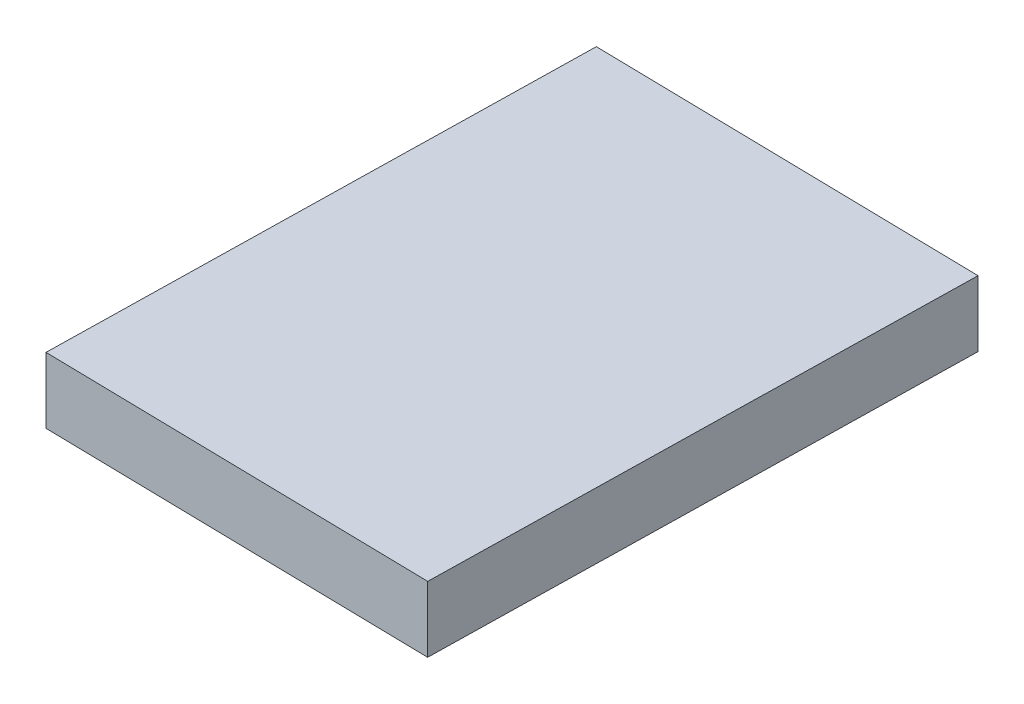
ISO-10303-21;
HEADER;
FILE_DESCRIPTION(('STEP AP214'),'2;1');
FILE_NAME('part.step','',(''),(''),'','','');
FILE_SCHEMA(('AUTOMOTIVE_DESIGN { 1 0 10303 214 1 1 1 1 }'));
ENDSEC;
DATA;
#1=APPLICATION_CONTEXT('core data for automotive mechanical design processes');
#2=APPLICATION_PROTOCOL_DEFINITION('international standard','automotive_design',2000,#1);
#3=PRODUCT_CONTEXT('',#1,'mechanical');
#4=PRODUCT('Part','Part','',(#3));
#5=PRODUCT_RELATED_PRODUCT_CATEGORY('part','',(#4));
#6=PRODUCT_DEFINITION_FORMATION('','',#4);
#7=PRODUCT_DEFINITION_CONTEXT('part definition',#1,'design');
#8=PRODUCT_DEFINITION('design','',#6,#7);
#9=PRODUCT_DEFINITION_SHAPE('','',#8);
#10=(LENGTH_UNIT() NAMED_UNIT(*) SI_UNIT(.MILLI.,.METRE.));
#11=(NAMED_UNIT(*) PLANE_ANGLE_UNIT() SI_UNIT($,.RADIAN.));
#12=(NAMED_UNIT(*) SI_UNIT($,.STERADIAN.) SOLID_ANGLE_UNIT());
#13=UNCERTAINTY_MEASURE_WITH_UNIT(LENGTH_MEASURE(1.E-05),#10,'distance_accuracy_value','');
#14=(GEOMETRIC_REPRESENTATION_CONTEXT(3) GLOBAL_UNCERTAINTY_ASSIGNED_CONTEXT((#13)) GLOBAL_UNIT_ASSIGNED_CONTEXT((#10,
#11,#12)) REPRESENTATION_CONTEXT('',''));
#15=CARTESIAN_POINT('',(0.,0.,0.));
#16=DIRECTION('',(0.,0.,1.));
#17=DIRECTION('',(1.,0.,0.));
#18=AXIS2_PLACEMENT_3D('',#15,#16,#17);
#19=CARTESIAN_POINT('',(-0.387656007981527,-0.780392670707814,32.6889272074211));
#20=DIRECTION('',(0.,1.,0.));
#21=DIRECTION('',(1.,0.,0.));
#22=AXIS2_PLACEMENT_3D('',#19,#20,#21);
#23=PLANE('',#22);
#24=DIRECTION('',(0.999812677663925,0.,0.0193548335692299));
#25=VECTOR('',#24,1.);
#26=CARTESIAN_POINT('',(-9.16084763194295,-0.780392670708278,20.0072479818905));
#27=LINE('',#26,#25);
#28=CARTESIAN_POINT('',(-9.16084763194288,-0.780392670708188,20.0072479818905));
#29=VERTEX_POINT('',#28);
#30=CARTESIAN_POINT('',(8.86977419704837,-0.780392670707841,20.356293050478));
#31=VERTEX_POINT('',#30);
#32=EDGE_CURVE('E56',#29,#31,#27,.T.);
#33=ORIENTED_EDGE('',*,*,#32,.T.);
#34=DIRECTION('',(-0.0193548335692301,0.,0.999812677663925));
#35=VECTOR('',#34,1.);
#36=CARTESIAN_POINT('',(8.3855356159798,-0.780392670707703,45.3706064329517));
#37=LINE('',#36,#35);
#38=CARTESIAN_POINT('',(8.38553561597977,-0.780392670707446,45.3706064329517));
#39=VERTEX_POINT('',#38);
#40=EDGE_CURVE('E58',#31,#39,#37,.T.);
#41=ORIENTED_EDGE('',*,*,#40,.T.);
#42=DIRECTION('',(-0.999812677663925,0.,-0.0193548335692299));
#43=VECTOR('',#42,1.);
#44=CARTESIAN_POINT('',(-9.64508621301152,-0.780392670707363,45.0215613643643));
#45=LINE('',#44,#43);
#46=CARTESIAN_POINT('',(-9.64508621301142,-0.780392670707647,45.0215613643642));
#47=VERTEX_POINT('',#46);
#48=EDGE_CURVE('E20',#39,#47,#45,.T.);
#49=ORIENTED_EDGE('',*,*,#48,.T.);
#50=DIRECTION('',(0.0193548335692301,0.,-0.999812677663925));
#51=VECTOR('',#50,1.);
#52=CARTESIAN_POINT('',(-9.64508621301142,-0.780392670707938,45.0215613643642));
#53=LINE('',#52,#51);
#54=EDGE_CURVE('E88',#47,#29,#53,.T.);
#55=ORIENTED_EDGE('',*,*,#54,.T.);
#56=EDGE_LOOP('',(#33,#41,#49,#55));
#57=FACE_BOUND('',#56,.T.);
#58=ADVANCED_FACE('F17',(#57),#23,.F.);
#59=CARTESIAN_POINT('',(-9.64508621301152,2.26760732929205,45.0215613643642));
#60=DIRECTION('',(0.0193548335692299,0.,-0.999812677663925));
#61=DIRECTION('',(-0.999812677663925,0.,-0.0193548335692299));
#62=AXIS2_PLACEMENT_3D('',#59,#60,#61);
#63=PLANE('',#62);
#64=ORIENTED_EDGE('',*,*,#48,.F.);
#65=DIRECTION('',(0.,1.,0.));
#66=VECTOR('',#65,1.);
#67=CARTESIAN_POINT('',(8.3855356159797,2.26760732929264,45.3706064329517));
#68=LINE('',#67,#66);
#69=CARTESIAN_POINT('',(8.3855356159797,2.26760732929235,45.3706064329517));
#70=VERTEX_POINT('',#69);
#71=EDGE_CURVE('E65',#39,#70,#68,.T.);
#72=ORIENTED_EDGE('',*,*,#71,.T.);
#73=DIRECTION('',(0.999812677663925,0.,0.0193548335692301));
#74=VECTOR('',#73,1.);
#75=CARTESIAN_POINT('',(-9.64508621301152,2.26760732929207,45.0215613643642));
#76=LINE('',#75,#74);
#77=CARTESIAN_POINT('',(-9.64508621301147,2.26760732929198,45.0215613643642));
#78=VERTEX_POINT('',#77);
#79=EDGE_CURVE('E93',#78,#70,#76,.T.);
#80=ORIENTED_EDGE('',*,*,#79,.F.);
#81=DIRECTION('',(0.,1.,0.));
#82=VECTOR('',#81,1.);
#83=CARTESIAN_POINT('',(-9.64508621301152,2.26760732929205,45.0215613643642));
#84=LINE('',#83,#82);
#85=EDGE_CURVE('E70',#78,#47,#84,.F.);
#86=ORIENTED_EDGE('',*,*,#85,.T.);
#87=EDGE_LOOP('',(#64,#72,#80,#86));
#88=FACE_BOUND('',#87,.T.);
#89=ADVANCED_FACE('F67',(#88),#63,.F.);
#90=CARTESIAN_POINT('',(8.3855356159797,2.26760732929264,45.3706064329517));
#91=DIRECTION('',(-0.999812677663925,0.,-0.0193548335692301));
#92=DIRECTION('',(-0.0193548335692301,0.,0.999812677663925));
#93=AXIS2_PLACEMENT_3D('',#90,#91,#92);
#94=PLANE('',#93);
#95=ORIENTED_EDGE('',*,*,#40,.F.);
#96=DIRECTION('',(0.,1.,0.));
#97=VECTOR('',#96,1.);
#98=CARTESIAN_POINT('',(8.86977419704837,2.26760732929172,20.356293050478));
#99=LINE('',#98,#97);
#100=CARTESIAN_POINT('',(8.86977419704829,2.26760732929248,20.356293050478));
#101=VERTEX_POINT('',#100);
#102=EDGE_CURVE('E81',#31,#101,#99,.T.);
#103=ORIENTED_EDGE('',*,*,#102,.T.);
#104=DIRECTION('',(0.0193548335692301,0.,-0.999812677663925));
#105=VECTOR('',#104,1.);
#106=CARTESIAN_POINT('',(8.3855356159797,2.26760732929264,45.3706064329517));
#107=LINE('',#106,#105);
#108=EDGE_CURVE('E75',#70,#101,#107,.T.);
#109=ORIENTED_EDGE('',*,*,#108,.F.);
#110=ORIENTED_EDGE('',*,*,#71,.F.);
#111=EDGE_LOOP('',(#95,#103,#109,#110));
#112=FACE_BOUND('',#111,.T.);
#113=ADVANCED_FACE('F73',(#112),#94,.F.);
#114=CARTESIAN_POINT('',(-9.16084763194295,2.26760732929172,20.0072479818905));
#115=DIRECTION('',(-0.0193548335692299,0.,0.999812677663925));
#116=DIRECTION('',(0.999812677663925,0.,0.0193548335692299));
#117=AXIS2_PLACEMENT_3D('',#114,#115,#116);
#118=PLANE('',#117);
#119=ORIENTED_EDGE('',*,*,#32,.F.);
#120=DIRECTION('',(0.,1.,0.));
#121=VECTOR('',#120,1.);
#122=CARTESIAN_POINT('',(-9.16084763194295,2.26760732929205,20.0072479818905));
#123=LINE('',#122,#121);
#124=CARTESIAN_POINT('',(-9.16084763194295,2.26760732929201,20.0072479818905));
#125=VERTEX_POINT('',#124);
#126=EDGE_CURVE('E36',#29,#125,#123,.T.);
#127=ORIENTED_EDGE('',*,*,#126,.T.);
#128=DIRECTION('',(-0.999812677663925,0.,-0.0193548335692299));
#129=VECTOR('',#128,1.);
#130=CARTESIAN_POINT('',(8.86977419704827,2.2676073292923,20.356293050478));
#131=LINE('',#130,#129);
#132=EDGE_CURVE('E27',#101,#125,#131,.T.);
#133=ORIENTED_EDGE('',*,*,#132,.F.);
#134=ORIENTED_EDGE('',*,*,#102,.F.);
#135=EDGE_LOOP('',(#119,#127,#133,#134));
#136=FACE_BOUND('',#135,.T.);
#137=ADVANCED_FACE('F102',(#136),#118,.F.);
#138=CARTESIAN_POINT('',(-9.64508621301152,2.26760732929205,45.0215613643642));
#139=DIRECTION('',(0.999812677663925,0.,0.0193548335692301));
#140=DIRECTION('',(0.0193548335692301,0.,-0.999812677663925));
#141=AXIS2_PLACEMENT_3D('',#138,#139,#140);
#142=PLANE('',#141);
#143=ORIENTED_EDGE('',*,*,#54,.F.);
#144=ORIENTED_EDGE('',*,*,#85,.F.);
#145=DIRECTION('',(-0.0193548335692301,0.,0.999812677663925));
#146=VECTOR('',#145,1.);
#147=CARTESIAN_POINT('',(-9.16084763194295,2.26760732929172,20.0072479818905));
#148=LINE('',#147,#146);
#149=EDGE_CURVE('E11',#125,#78,#148,.T.);
#150=ORIENTED_EDGE('',*,*,#149,.F.);
#151=ORIENTED_EDGE('',*,*,#126,.F.);
#152=EDGE_LOOP('',(#143,#144,#150,#151));
#153=FACE_BOUND('',#152,.T.);
#154=ADVANCED_FACE('F104',(#153),#142,.F.);
#155=CARTESIAN_POINT('',(-0.387656007981624,2.26760732929218,32.6889272074211));
#156=DIRECTION('',(0.,1.,0.));
#157=DIRECTION('',(1.,0.,0.));
#158=AXIS2_PLACEMENT_3D('',#155,#156,#157);
#159=PLANE('',#158);
#160=ORIENTED_EDGE('',*,*,#132,.T.);
#161=ORIENTED_EDGE('',*,*,#149,.T.);
#162=ORIENTED_EDGE('',*,*,#79,.T.);
#163=ORIENTED_EDGE('',*,*,#108,.T.);
#164=EDGE_LOOP('',(#160,#161,#162,#163));
#165=FACE_BOUND('',#164,.T.);
#166=ADVANCED_FACE('F101',(#165),#159,.T.);
#167=CLOSED_SHELL('',(#58,#89,#113,#137,#154,#166));
#168=MANIFOLD_SOLID_BREP('B1',#167);
#169=ADVANCED_BREP_SHAPE_REPRESENTATION('',(#18,#168),#14);
#170=SHAPE_DEFINITION_REPRESENTATION(#9,#169);
ENDSEC;
END-ISO-10303-21;
